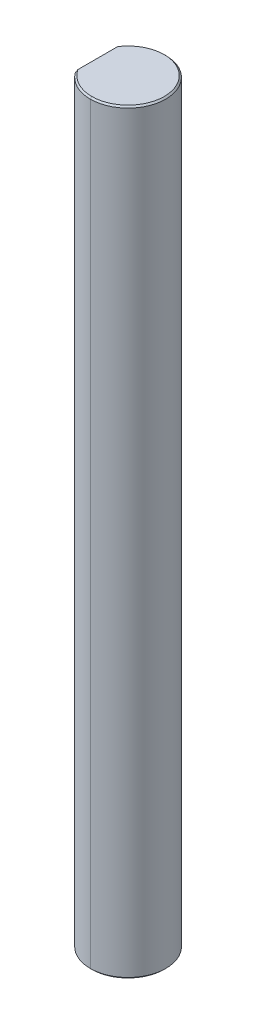
ISO-10303-21;
HEADER;
FILE_DESCRIPTION(('STEP AP214'),'2;1');
FILE_NAME('part.step','',(''),(''),'','','');
FILE_SCHEMA(('AUTOMOTIVE_DESIGN { 1 0 10303 214 1 1 1 1 }'));
ENDSEC;
DATA;
#1=APPLICATION_CONTEXT('core data for automotive mechanical design processes');
#2=APPLICATION_PROTOCOL_DEFINITION('international standard','automotive_design',2000,#1);
#3=PRODUCT_CONTEXT('',#1,'mechanical');
#4=PRODUCT('Part','Part','',(#3));
#5=PRODUCT_RELATED_PRODUCT_CATEGORY('part','',(#4));
#6=PRODUCT_DEFINITION_FORMATION('','',#4);
#7=PRODUCT_DEFINITION_CONTEXT('part definition',#1,'design');
#8=PRODUCT_DEFINITION('design','',#6,#7);
#9=PRODUCT_DEFINITION_SHAPE('','',#8);
#10=(LENGTH_UNIT() NAMED_UNIT(*) SI_UNIT(.MILLI.,.METRE.));
#11=(NAMED_UNIT(*) PLANE_ANGLE_UNIT() SI_UNIT($,.RADIAN.));
#12=(NAMED_UNIT(*) SI_UNIT($,.STERADIAN.) SOLID_ANGLE_UNIT());
#13=UNCERTAINTY_MEASURE_WITH_UNIT(LENGTH_MEASURE(1.E-05),#10,'distance_accuracy_value','');
#14=(GEOMETRIC_REPRESENTATION_CONTEXT(3) GLOBAL_UNCERTAINTY_ASSIGNED_CONTEXT((#13)) GLOBAL_UNIT_ASSIGNED_CONTEXT((#10,
#11,#12)) REPRESENTATION_CONTEXT('',''));
#15=CARTESIAN_POINT('',(0.,0.,0.));
#16=DIRECTION('',(0.,0.,1.));
#17=DIRECTION('',(1.,0.,0.));
#18=AXIS2_PLACEMENT_3D('',#15,#16,#17);
#19=CARTESIAN_POINT('',(0.,63.5,0.));
#20=DIRECTION('',(0.,-1.,0.));
#21=DIRECTION('',(0.,0.,-1.));
#22=AXIS2_PLACEMENT_3D('',#19,#20,#21);
#23=CONICAL_SURFACE('',#22,3.04419,0.785398163397511);
#24=DIRECTION('',(0.,-0.707106781186503,0.707106781186592));
#25=VECTOR('',#24,1.);
#26=CARTESIAN_POINT('',(0.,63.5,3.04419));
#27=LINE('',#26,#25);
#28=CARTESIAN_POINT('',(0.,63.5,3.04419));
#29=VERTEX_POINT('',#28);
#30=CARTESIAN_POINT('',(0.,63.373,3.17119));
#31=VERTEX_POINT('',#30);
#32=EDGE_CURVE('E182',#29,#31,#27,.T.);
#33=ORIENTED_EDGE('',*,*,#32,.F.);
#34=CARTESIAN_POINT('',(0.,63.5,0.));
#35=DIRECTION('',(0.,1.,0.));
#36=DIRECTION('',(0.,0.,1.));
#37=AXIS2_PLACEMENT_3D('',#34,#35,#36);
#38=CIRCLE('',#37,3.04419);
#39=CARTESIAN_POINT('',(-2.54381,63.5,1.67216130800826));
#40=VERTEX_POINT('',#39);
#41=EDGE_CURVE('E27',#40,#29,#38,.T.);
#42=ORIENTED_EDGE('',*,*,#41,.F.);
#43=CARTESIAN_POINT('',(-2.54381,63.373,1.89353550270387));
#44=CARTESIAN_POINT('',(-2.54381,63.4166137464441,1.82049357854219));
#45=CARTESIAN_POINT('',(-2.54381,63.459042414268,1.74672509100729));
#46=CARTESIAN_POINT('',(-2.54381,63.5,1.67216130800826));
#47=(BOUNDED_CURVE() B_SPLINE_CURVE(3,(#43,#44,#45,#46),.UNSPECIFIED.,.F.,
.F.) B_SPLINE_CURVE_WITH_KNOTS((4,4),(0.,0.000255216641458061),
.UNSPECIFIED.) CURVE() GEOMETRIC_REPRESENTATION_ITEM() RATIONAL_B_SPLINE_CURVE((1.,1.,1.,1.)) REPRESENTATION_ITEM(''));
#48=CARTESIAN_POINT('',(-2.54381,63.373,1.89353550270387));
#49=VERTEX_POINT('',#48);
#50=EDGE_CURVE('E109',#49,#40,#47,.T.);
#51=ORIENTED_EDGE('',*,*,#50,.F.);
#52=CARTESIAN_POINT('',(0.,63.373,0.));
#53=DIRECTION('',(0.,-1.,0.));
#54=DIRECTION('',(0.,0.,1.));
#55=AXIS2_PLACEMENT_3D('',#52,#53,#54);
#56=CIRCLE('',#55,3.17119);
#57=EDGE_CURVE('E100',#31,#49,#56,.T.);
#58=ORIENTED_EDGE('',*,*,#57,.F.);
#59=EDGE_LOOP('',(#33,#42,#51,#58));
#60=FACE_BOUND('',#59,.T.);
#61=ADVANCED_FACE('F16',(#60),#23,.T.);
#62=CARTESIAN_POINT('',(0.,0.126999999999988,0.));
#63=DIRECTION('',(0.,1.,0.));
#64=DIRECTION('',(0.,0.,1.));
#65=AXIS2_PLACEMENT_3D('',#62,#63,#64);
#66=CONICAL_SURFACE('',#65,3.17119,0.785398163397484);
#67=DIRECTION('',(0.,0.707106781186522,-0.707106781186573));
#68=VECTOR('',#67,1.);
#69=CARTESIAN_POINT('',(0.,0.126999999999988,-3.17119));
#70=LINE('',#69,#68);
#71=CARTESIAN_POINT('',(0.,0.,-3.04419));
#72=VERTEX_POINT('',#71);
#73=CARTESIAN_POINT('',(0.,0.126999999999988,-3.17119));
#74=VERTEX_POINT('',#73);
#75=EDGE_CURVE('E198',#72,#74,#70,.T.);
#76=ORIENTED_EDGE('',*,*,#75,.F.);
#77=CARTESIAN_POINT('',(0.,0.,0.));
#78=DIRECTION('',(0.,-1.,0.));
#79=DIRECTION('',(0.,0.,1.));
#80=AXIS2_PLACEMENT_3D('',#77,#78,#79);
#81=CIRCLE('',#80,3.04419);
#82=CARTESIAN_POINT('',(-2.54381,0.,-1.6721613080083));
#83=VERTEX_POINT('',#82);
#84=EDGE_CURVE('E10',#83,#72,#81,.T.);
#85=ORIENTED_EDGE('',*,*,#84,.F.);
#86=CARTESIAN_POINT('',(-2.54381,0.126999999999988,-1.89353550270387));
#87=CARTESIAN_POINT('',(-2.54381,0.0833862535559409,-1.82049357854221));
#88=CARTESIAN_POINT('',(-2.54381,0.0409575857320522,-1.74672509100732));
#89=CARTESIAN_POINT('',(-2.54381,0.,-1.6721613080083));
#90=(BOUNDED_CURVE() B_SPLINE_CURVE(3,(#86,#87,#88,#89),.UNSPECIFIED.,.F.,
.F.) B_SPLINE_CURVE_WITH_KNOTS((4,4),(0.,0.000255216641458019),
.UNSPECIFIED.) CURVE() GEOMETRIC_REPRESENTATION_ITEM() RATIONAL_B_SPLINE_CURVE((1.,1.,1.,1.)) REPRESENTATION_ITEM(''));
#91=CARTESIAN_POINT('',(-2.54381,0.126999999999988,-1.89353550270387));
#92=VERTEX_POINT('',#91);
#93=EDGE_CURVE('E128',#92,#83,#90,.T.);
#94=ORIENTED_EDGE('',*,*,#93,.F.);
#95=CARTESIAN_POINT('',(0.,0.126999999999988,0.));
#96=DIRECTION('',(0.,1.,0.));
#97=DIRECTION('',(0.,0.,1.));
#98=AXIS2_PLACEMENT_3D('',#95,#96,#97);
#99=CIRCLE('',#98,3.17119);
#100=EDGE_CURVE('E20',#74,#92,#99,.T.);
#101=ORIENTED_EDGE('',*,*,#100,.F.);
#102=EDGE_LOOP('',(#76,#85,#94,#101));
#103=FACE_BOUND('',#102,.T.);
#104=ADVANCED_FACE('F250',(#103),#66,.T.);
#105=CARTESIAN_POINT('',(0.,0.,0.));
#106=DIRECTION('',(0.,1.,0.));
#107=DIRECTION('',(1.,0.,0.));
#108=AXIS2_PLACEMENT_3D('',#105,#106,#107);
#109=PLANE('',#108);
#110=DIRECTION('',(0.,0.,1.));
#111=VECTOR('',#110,1.);
#112=CARTESIAN_POINT('',(-2.54381,0.,-1.89353550270387));
#113=LINE('',#112,#111);
#114=CARTESIAN_POINT('',(-2.54381,0.,1.6721613080083));
#115=VERTEX_POINT('',#114);
#116=EDGE_CURVE('E115',#83,#115,#113,.T.);
#117=ORIENTED_EDGE('',*,*,#116,.F.);
#118=ORIENTED_EDGE('',*,*,#84,.T.);
#119=CARTESIAN_POINT('',(0.,0.,0.));
#120=DIRECTION('',(0.,-1.,0.));
#121=DIRECTION('',(0.,0.,1.));
#122=AXIS2_PLACEMENT_3D('',#119,#120,#121);
#123=CIRCLE('',#122,3.04419);
#124=CARTESIAN_POINT('',(0.,0.,3.04419));
#125=VERTEX_POINT('',#124);
#126=EDGE_CURVE('E168',#72,#125,#123,.T.);
#127=ORIENTED_EDGE('',*,*,#126,.T.);
#128=CARTESIAN_POINT('',(0.,0.,0.));
#129=DIRECTION('',(0.,-1.,0.));
#130=DIRECTION('',(0.,0.,1.));
#131=AXIS2_PLACEMENT_3D('',#128,#129,#130);
#132=CIRCLE('',#131,3.04419);
#133=EDGE_CURVE('E185',#125,#115,#132,.T.);
#134=ORIENTED_EDGE('',*,*,#133,.T.);
#135=EDGE_LOOP('',(#117,#118,#127,#134));
#136=FACE_BOUND('',#135,.T.);
#137=ADVANCED_FACE('F255',(#136),#109,.F.);
#138=CARTESIAN_POINT('',(0.,63.5,0.));
#139=DIRECTION('',(0.,1.,0.));
#140=DIRECTION('',(1.,0.,0.));
#141=AXIS2_PLACEMENT_3D('',#138,#139,#140);
#142=PLANE('',#141);
#143=DIRECTION('',(0.,0.,1.));
#144=VECTOR('',#143,1.);
#145=CARTESIAN_POINT('',(-2.54381,63.5,-1.89353550270387));
#146=LINE('',#145,#144);
#147=CARTESIAN_POINT('',(-2.54381,63.5,-1.67216130800826));
#148=VERTEX_POINT('',#147);
#149=EDGE_CURVE('E114',#148,#40,#146,.T.);
#150=ORIENTED_EDGE('',*,*,#149,.T.);
#151=ORIENTED_EDGE('',*,*,#41,.T.);
#152=CARTESIAN_POINT('',(0.,63.5,0.));
#153=DIRECTION('',(0.,1.,0.));
#154=DIRECTION('',(0.,0.,1.));
#155=AXIS2_PLACEMENT_3D('',#152,#153,#154);
#156=CIRCLE('',#155,3.04419);
#157=CARTESIAN_POINT('',(0.,63.5,-3.04419));
#158=VERTEX_POINT('',#157);
#159=EDGE_CURVE('E212',#29,#158,#156,.T.);
#160=ORIENTED_EDGE('',*,*,#159,.T.);
#161=CARTESIAN_POINT('',(0.,63.5,0.));
#162=DIRECTION('',(0.,1.,0.));
#163=DIRECTION('',(0.,0.,1.));
#164=AXIS2_PLACEMENT_3D('',#161,#162,#163);
#165=CIRCLE('',#164,3.04419);
#166=EDGE_CURVE('E90',#158,#148,#165,.T.);
#167=ORIENTED_EDGE('',*,*,#166,.T.);
#168=EDGE_LOOP('',(#150,#151,#160,#167));
#169=FACE_BOUND('',#168,.T.);
#170=ADVANCED_FACE('F232',(#169),#142,.T.);
#171=CARTESIAN_POINT('',(-2.54381,63.5,-1.89353550270387));
#172=DIRECTION('',(1.,0.,0.));
#173=DIRECTION('',(0.,1.,0.));
#174=AXIS2_PLACEMENT_3D('',#171,#172,#173);
#175=PLANE('',#174);
#176=DIRECTION('',(0.,-1.,0.));
#177=VECTOR('',#176,1.);
#178=CARTESIAN_POINT('',(-2.54381,63.5,-1.89353550270387));
#179=LINE('',#178,#177);
#180=CARTESIAN_POINT('',(-2.54381,63.373,-1.89353550270387));
#181=VERTEX_POINT('',#180);
#182=EDGE_CURVE('E134',#181,#92,#179,.T.);
#183=ORIENTED_EDGE('',*,*,#182,.T.);
#184=ORIENTED_EDGE('',*,*,#93,.T.);
#185=ORIENTED_EDGE('',*,*,#116,.T.);
#186=CARTESIAN_POINT('',(-2.54381,0.,1.6721613080083));
#187=CARTESIAN_POINT('',(-2.54381,0.0409575857320583,1.74672509100731));
#188=CARTESIAN_POINT('',(-2.54381,0.0833862535559373,1.82049357854221));
#189=CARTESIAN_POINT('',(-2.54381,0.126999999999988,1.89353550270387));
#190=(BOUNDED_CURVE() B_SPLINE_CURVE(3,(#186,#187,#188,#189),.UNSPECIFIED.,.F.,
.F.) B_SPLINE_CURVE_WITH_KNOTS((4,4),(0.,0.000255216641458019),
.UNSPECIFIED.) CURVE() GEOMETRIC_REPRESENTATION_ITEM() RATIONAL_B_SPLINE_CURVE((1.,1.,1.,1.)) REPRESENTATION_ITEM(''));
#191=CARTESIAN_POINT('',(-2.54381,0.126999999999988,1.89353550270387));
#192=VERTEX_POINT('',#191);
#193=EDGE_CURVE('E123',#115,#192,#190,.T.);
#194=ORIENTED_EDGE('',*,*,#193,.T.);
#195=DIRECTION('',(0.,-1.,0.));
#196=VECTOR('',#195,1.);
#197=CARTESIAN_POINT('',(-2.54381,63.5,1.89353550270387));
#198=LINE('',#197,#196);
#199=EDGE_CURVE('E118',#49,#192,#198,.T.);
#200=ORIENTED_EDGE('',*,*,#199,.F.);
#201=ORIENTED_EDGE('',*,*,#50,.T.);
#202=ORIENTED_EDGE('',*,*,#149,.F.);
#203=CARTESIAN_POINT('',(-2.54381,63.5,-1.67216130800826));
#204=CARTESIAN_POINT('',(-2.54381,63.4590424142679,-1.74672509100729));
#205=CARTESIAN_POINT('',(-2.54381,63.4166137464441,-1.8204935785422));
#206=CARTESIAN_POINT('',(-2.54381,63.373,-1.89353550270387));
#207=(BOUNDED_CURVE() B_SPLINE_CURVE(3,(#203,#204,#205,#206),.UNSPECIFIED.,.F.,
.F.) B_SPLINE_CURVE_WITH_KNOTS((4,4),(0.,0.000255216641458059),
.UNSPECIFIED.) CURVE() GEOMETRIC_REPRESENTATION_ITEM() RATIONAL_B_SPLINE_CURVE((1.,1.,1.,1.)) REPRESENTATION_ITEM(''));
#208=EDGE_CURVE('E160',#148,#181,#207,.T.);
#209=ORIENTED_EDGE('',*,*,#208,.T.);
#210=EDGE_LOOP('',(#183,#184,#185,#194,#200,#201,#202,#209));
#211=FACE_BOUND('',#210,.T.);
#212=ADVANCED_FACE('F120',(#211),#175,.F.);
#213=CARTESIAN_POINT('',(0.,63.5,0.));
#214=DIRECTION('',(0.,-1.,0.));
#215=DIRECTION('',(0.,0.,-1.));
#216=AXIS2_PLACEMENT_3D('',#213,#214,#215);
#217=CYLINDRICAL_SURFACE('',#216,3.17119);
#218=DIRECTION('',(0.,-1.,0.));
#219=VECTOR('',#218,1.);
#220=CARTESIAN_POINT('',(0.,63.5,3.17119));
#221=LINE('',#220,#219);
#222=CARTESIAN_POINT('',(0.,0.126999999999988,3.17119));
#223=VERTEX_POINT('',#222);
#224=EDGE_CURVE('E131',#31,#223,#221,.T.);
#225=ORIENTED_EDGE('',*,*,#224,.F.);
#226=ORIENTED_EDGE('',*,*,#57,.T.);
#227=ORIENTED_EDGE('',*,*,#199,.T.);
#228=CARTESIAN_POINT('',(0.,0.126999999999988,0.));
#229=DIRECTION('',(0.,1.,0.));
#230=DIRECTION('',(0.,0.,1.));
#231=AXIS2_PLACEMENT_3D('',#228,#229,#230);
#232=CIRCLE('',#231,3.17119);
#233=EDGE_CURVE('E150',#192,#223,#232,.T.);
#234=ORIENTED_EDGE('',*,*,#233,.T.);
#235=EDGE_LOOP('',(#225,#226,#227,#234));
#236=FACE_BOUND('',#235,.T.);
#237=ADVANCED_FACE('F130',(#236),#217,.T.);
#238=CARTESIAN_POINT('',(0.,63.5,0.));
#239=DIRECTION('',(0.,-1.,0.));
#240=DIRECTION('',(0.,0.,-1.));
#241=AXIS2_PLACEMENT_3D('',#238,#239,#240);
#242=CYLINDRICAL_SURFACE('',#241,3.17119);
#243=CARTESIAN_POINT('',(0.,63.373,0.));
#244=DIRECTION('',(0.,-1.,0.));
#245=DIRECTION('',(0.,0.,1.));
#246=AXIS2_PLACEMENT_3D('',#243,#244,#245);
#247=CIRCLE('',#246,3.17119);
#248=CARTESIAN_POINT('',(0.,63.373,-3.17119));
#249=VERTEX_POINT('',#248);
#250=EDGE_CURVE('E157',#181,#249,#247,.T.);
#251=ORIENTED_EDGE('',*,*,#250,.T.);
#252=DIRECTION('',(0.,-1.,0.));
#253=VECTOR('',#252,1.);
#254=CARTESIAN_POINT('',(0.,63.5,-3.17119));
#255=LINE('',#254,#253);
#256=EDGE_CURVE('E151',#249,#74,#255,.T.);
#257=ORIENTED_EDGE('',*,*,#256,.T.);
#258=ORIENTED_EDGE('',*,*,#100,.T.);
#259=ORIENTED_EDGE('',*,*,#182,.F.);
#260=EDGE_LOOP('',(#251,#257,#258,#259));
#261=FACE_BOUND('',#260,.T.);
#262=ADVANCED_FACE('F274',(#261),#242,.T.);
#263=CARTESIAN_POINT('',(0.,63.5,0.));
#264=DIRECTION('',(0.,-1.,0.));
#265=DIRECTION('',(0.,0.,-1.));
#266=AXIS2_PLACEMENT_3D('',#263,#264,#265);
#267=CYLINDRICAL_SURFACE('',#266,3.17119);
#268=CARTESIAN_POINT('',(0.,63.373,0.));
#269=DIRECTION('',(0.,-1.,0.));
#270=DIRECTION('',(0.,0.,1.));
#271=AXIS2_PLACEMENT_3D('',#268,#269,#270);
#272=CIRCLE('',#271,3.17119);
#273=EDGE_CURVE('E175',#249,#31,#272,.T.);
#274=ORIENTED_EDGE('',*,*,#273,.T.);
#275=ORIENTED_EDGE('',*,*,#224,.T.);
#276=CARTESIAN_POINT('',(0.,0.126999999999988,0.));
#277=DIRECTION('',(0.,1.,0.));
#278=DIRECTION('',(0.,0.,1.));
#279=AXIS2_PLACEMENT_3D('',#276,#277,#278);
#280=CIRCLE('',#279,3.17119);
#281=EDGE_CURVE('E190',#223,#74,#280,.T.);
#282=ORIENTED_EDGE('',*,*,#281,.T.);
#283=ORIENTED_EDGE('',*,*,#256,.F.);
#284=EDGE_LOOP('',(#274,#275,#282,#283));
#285=FACE_BOUND('',#284,.T.);
#286=ADVANCED_FACE('F271',(#285),#267,.T.);
#287=CARTESIAN_POINT('',(0.,0.126999999999988,0.));
#288=DIRECTION('',(0.,1.,0.));
#289=DIRECTION('',(0.,0.,1.));
#290=AXIS2_PLACEMENT_3D('',#287,#288,#289);
#291=CONICAL_SURFACE('',#290,3.17119,0.785398163397484);
#292=ORIENTED_EDGE('',*,*,#133,.F.);
#293=DIRECTION('',(0.,0.707106781186522,0.707106781186573));
#294=VECTOR('',#293,1.);
#295=CARTESIAN_POINT('',(0.,0.126999999999988,3.17119));
#296=LINE('',#295,#294);
#297=EDGE_CURVE('E197',#125,#223,#296,.T.);
#298=ORIENTED_EDGE('',*,*,#297,.T.);
#299=ORIENTED_EDGE('',*,*,#233,.F.);
#300=ORIENTED_EDGE('',*,*,#193,.F.);
#301=EDGE_LOOP('',(#292,#298,#299,#300));
#302=FACE_BOUND('',#301,.T.);
#303=ADVANCED_FACE('F245',(#302),#291,.T.);
#304=CARTESIAN_POINT('',(0.,0.126999999999988,0.));
#305=DIRECTION('',(0.,1.,0.));
#306=DIRECTION('',(0.,0.,1.));
#307=AXIS2_PLACEMENT_3D('',#304,#305,#306);
#308=CONICAL_SURFACE('',#307,3.17119,0.785398163397484);
#309=ORIENTED_EDGE('',*,*,#126,.F.);
#310=ORIENTED_EDGE('',*,*,#75,.T.);
#311=ORIENTED_EDGE('',*,*,#281,.F.);
#312=ORIENTED_EDGE('',*,*,#297,.F.);
#313=EDGE_LOOP('',(#309,#310,#311,#312));
#314=FACE_BOUND('',#313,.T.);
#315=ADVANCED_FACE('F18',(#314),#308,.T.);
#316=CARTESIAN_POINT('',(0.,63.5,0.));
#317=DIRECTION('',(0.,-1.,0.));
#318=DIRECTION('',(0.,0.,-1.));
#319=AXIS2_PLACEMENT_3D('',#316,#317,#318);
#320=CONICAL_SURFACE('',#319,3.04419,0.785398163397511);
#321=ORIENTED_EDGE('',*,*,#166,.F.);
#322=DIRECTION('',(0.,-0.707106781186503,-0.707106781186592));
#323=VECTOR('',#322,1.);
#324=CARTESIAN_POINT('',(0.,63.5,-3.04419));
#325=LINE('',#324,#323);
#326=EDGE_CURVE('E170',#158,#249,#325,.T.);
#327=ORIENTED_EDGE('',*,*,#326,.T.);
#328=ORIENTED_EDGE('',*,*,#250,.F.);
#329=ORIENTED_EDGE('',*,*,#208,.F.);
#330=EDGE_LOOP('',(#321,#327,#328,#329));
#331=FACE_BOUND('',#330,.T.);
#332=ADVANCED_FACE('F235',(#331),#320,.T.);
#333=CARTESIAN_POINT('',(0.,63.5,0.));
#334=DIRECTION('',(0.,-1.,0.));
#335=DIRECTION('',(0.,0.,-1.));
#336=AXIS2_PLACEMENT_3D('',#333,#334,#335);
#337=CONICAL_SURFACE('',#336,3.04419,0.785398163397511);
#338=ORIENTED_EDGE('',*,*,#159,.F.);
#339=ORIENTED_EDGE('',*,*,#32,.T.);
#340=ORIENTED_EDGE('',*,*,#273,.F.);
#341=ORIENTED_EDGE('',*,*,#326,.F.);
#342=EDGE_LOOP('',(#338,#339,#340,#341));
#343=FACE_BOUND('',#342,.T.);
#344=ADVANCED_FACE('F237',(#343),#337,.T.);
#345=CLOSED_SHELL('',(#61,#104,#137,#170,#212,#237,#262,#286,#303,#315,#332,#344));
#346=MANIFOLD_SOLID_BREP('B1',#345);
#347=ADVANCED_BREP_SHAPE_REPRESENTATION('',(#18,#346),#14);
#348=SHAPE_DEFINITION_REPRESENTATION(#9,#347);
ENDSEC;
END-ISO-10303-21;
